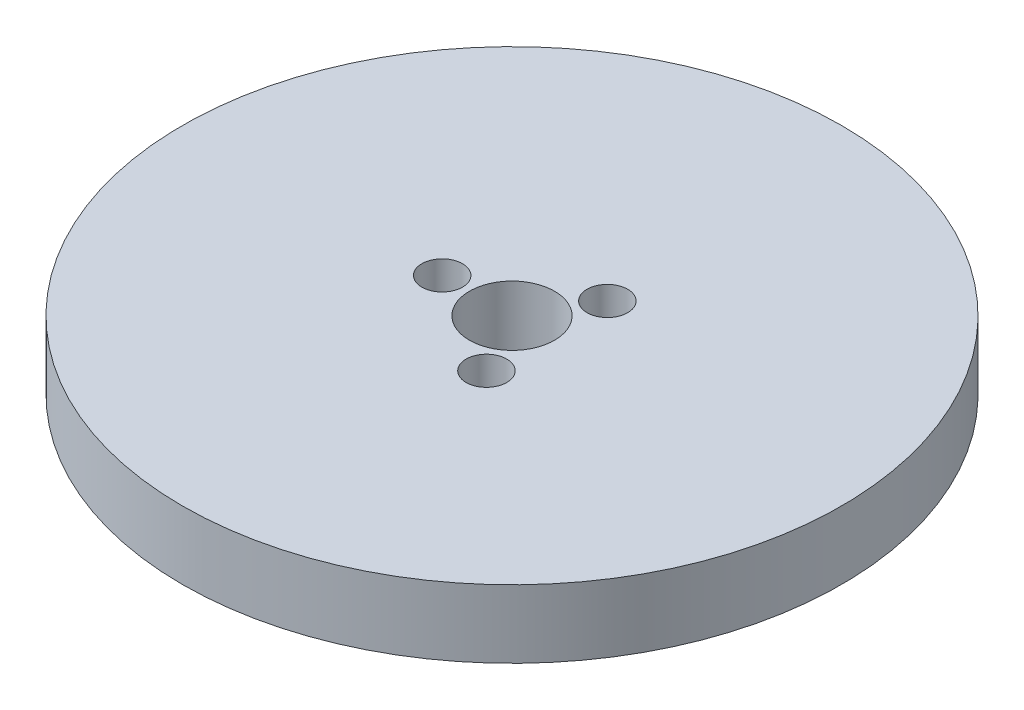
ISO-10303-21;
HEADER;
FILE_DESCRIPTION(('STEP AP214'),'2;1');
FILE_NAME('part.step','',(''),(''),'','','');
FILE_SCHEMA(('AUTOMOTIVE_DESIGN { 1 0 10303 214 1 1 1 1 }'));
ENDSEC;
DATA;
#1=APPLICATION_CONTEXT('core data for automotive mechanical design processes');
#2=APPLICATION_PROTOCOL_DEFINITION('international standard','automotive_design',2000,#1);
#3=PRODUCT_CONTEXT('',#1,'mechanical');
#4=PRODUCT('Part','Part','',(#3));
#5=PRODUCT_RELATED_PRODUCT_CATEGORY('part','',(#4));
#6=PRODUCT_DEFINITION_FORMATION('','',#4);
#7=PRODUCT_DEFINITION_CONTEXT('part definition',#1,'design');
#8=PRODUCT_DEFINITION('design','',#6,#7);
#9=PRODUCT_DEFINITION_SHAPE('','',#8);
#10=(LENGTH_UNIT() NAMED_UNIT(*) SI_UNIT(.MILLI.,.METRE.));
#11=(NAMED_UNIT(*) PLANE_ANGLE_UNIT() SI_UNIT($,.RADIAN.));
#12=(NAMED_UNIT(*) SI_UNIT($,.STERADIAN.) SOLID_ANGLE_UNIT());
#13=UNCERTAINTY_MEASURE_WITH_UNIT(LENGTH_MEASURE(1.E-05),#10,'distance_accuracy_value','');
#14=(GEOMETRIC_REPRESENTATION_CONTEXT(3) GLOBAL_UNCERTAINTY_ASSIGNED_CONTEXT((#13)) GLOBAL_UNIT_ASSIGNED_CONTEXT((#10,
#11,#12)) REPRESENTATION_CONTEXT('',''));
#15=CARTESIAN_POINT('',(0.,0.,0.));
#16=DIRECTION('',(0.,0.,1.));
#17=DIRECTION('',(1.,0.,0.));
#18=AXIS2_PLACEMENT_3D('',#15,#16,#17);
#19=CARTESIAN_POINT('',(0.,16.,0.));
#20=DIRECTION('',(0.,-1.,0.));
#21=DIRECTION('',(0.,0.,-1.));
#22=AXIS2_PLACEMENT_3D('',#19,#20,#21);
#23=CYLINDRICAL_SURFACE('',#22,77.5);
#24=CARTESIAN_POINT('',(0.,16.,0.));
#25=DIRECTION('',(0.,1.,0.));
#26=DIRECTION('',(0.,0.,1.));
#27=AXIS2_PLACEMENT_3D('',#24,#25,#26);
#28=CIRCLE('',#27,77.5);
#29=CARTESIAN_POINT('',(0.,16.,77.5));
#30=VERTEX_POINT('',#29);
#31=EDGE_CURVE('E10',#30,#30,#28,.T.);
#32=ORIENTED_EDGE('',*,*,#31,.F.);
#33=EDGE_LOOP('',(#32));
#34=FACE_BOUND('',#33,.T.);
#35=CARTESIAN_POINT('',(0.,0.,0.));
#36=DIRECTION('',(0.,1.,0.));
#37=DIRECTION('',(0.,0.,1.));
#38=AXIS2_PLACEMENT_3D('',#35,#36,#37);
#39=CIRCLE('',#38,77.5);
#40=CARTESIAN_POINT('',(0.,0.,77.5));
#41=VERTEX_POINT('',#40);
#42=EDGE_CURVE('E37',#41,#41,#39,.T.);
#43=ORIENTED_EDGE('',*,*,#42,.T.);
#44=EDGE_LOOP('',(#43));
#45=FACE_BOUND('',#44,.T.);
#46=ADVANCED_FACE('F40',(#34,#45),#23,.T.);
#47=CARTESIAN_POINT('',(0.,16.,0.));
#48=DIRECTION('',(0.,1.,0.));
#49=DIRECTION('',(0.,0.,1.));
#50=AXIS2_PLACEMENT_3D('',#47,#48,#49);
#51=PLANE('',#50);
#52=CARTESIAN_POINT('',(8.20769700924005,16.,14.2161482331347));
#53=DIRECTION('',(0.,1.,0.));
#54=DIRECTION('',(0.866025403784436,0.,-0.500000000000004));
#55=AXIS2_PLACEMENT_3D('',#52,#53,#54);
#56=CIRCLE('',#55,4.78368247568976);
#57=CARTESIAN_POINT('',(12.3504875568258,16.,11.8243069952898));
#58=VERTEX_POINT('',#57);
#59=EDGE_CURVE('E70',#58,#58,#56,.T.);
#60=ORIENTED_EDGE('',*,*,#59,.F.);
#61=EDGE_LOOP('',(#60));
#62=FACE_BOUND('',#61,.T.);
#63=CARTESIAN_POINT('',(8.20769700923985,16.,-14.2161482331348));
#64=DIRECTION('',(0.,1.,0.));
#65=DIRECTION('',(-0.866025403784443,0.,-0.499999999999992));
#66=AXIS2_PLACEMENT_3D('',#63,#64,#65);
#67=CIRCLE('',#66,4.78368247568976);
#68=CARTESIAN_POINT('',(4.06490646165406,16.,-16.6079894709797));
#69=VERTEX_POINT('',#68);
#70=EDGE_CURVE('E61',#69,#69,#67,.T.);
#71=ORIENTED_EDGE('',*,*,#70,.F.);
#72=EDGE_LOOP('',(#71));
#73=FACE_BOUND('',#72,.T.);
#74=CARTESIAN_POINT('',(-16.41539401848,16.,0.));
#75=DIRECTION('',(0.,1.,0.));
#76=DIRECTION('',(0.,0.,1.));
#77=AXIS2_PLACEMENT_3D('',#74,#75,#76);
#78=CIRCLE('',#77,4.78368247568976);
#79=CARTESIAN_POINT('',(-16.41539401848,16.,4.78368247568976));
#80=VERTEX_POINT('',#79);
#81=EDGE_CURVE('E54',#80,#80,#78,.T.);
#82=ORIENTED_EDGE('',*,*,#81,.F.);
#83=EDGE_LOOP('',(#82));
#84=FACE_BOUND('',#83,.T.);
#85=CARTESIAN_POINT('',(0.,16.,0.));
#86=DIRECTION('',(0.,1.,0.));
#87=DIRECTION('',(0.,0.,1.));
#88=AXIS2_PLACEMENT_3D('',#85,#86,#87);
#89=CIRCLE('',#88,10.);
#90=CARTESIAN_POINT('',(0.,16.,10.));
#91=VERTEX_POINT('',#90);
#92=EDGE_CURVE('E50',#91,#91,#89,.T.);
#93=ORIENTED_EDGE('',*,*,#92,.F.);
#94=EDGE_LOOP('',(#93));
#95=FACE_BOUND('',#94,.T.);
#96=ORIENTED_EDGE('',*,*,#31,.T.);
#97=EDGE_LOOP('',(#96));
#98=FACE_BOUND('',#97,.T.);
#99=ADVANCED_FACE('F85',(#62,#73,#84,#95,#98),#51,.T.);
#100=CARTESIAN_POINT('',(0.,0.,0.));
#101=DIRECTION('',(0.,1.,0.));
#102=DIRECTION('',(0.,0.,1.));
#103=AXIS2_PLACEMENT_3D('',#100,#101,#102);
#104=PLANE('',#103);
#105=CARTESIAN_POINT('',(0.,0.,0.));
#106=DIRECTION('',(0.,1.,0.));
#107=DIRECTION('',(0.,0.,1.));
#108=AXIS2_PLACEMENT_3D('',#105,#106,#107);
#109=CIRCLE('',#108,10.);
#110=CARTESIAN_POINT('',(0.,0.,10.));
#111=VERTEX_POINT('',#110);
#112=EDGE_CURVE('E47',#111,#111,#109,.T.);
#113=ORIENTED_EDGE('',*,*,#112,.T.);
#114=EDGE_LOOP('',(#113));
#115=FACE_BOUND('',#114,.T.);
#116=ORIENTED_EDGE('',*,*,#42,.F.);
#117=EDGE_LOOP('',(#116));
#118=FACE_BOUND('',#117,.T.);
#119=ADVANCED_FACE('F84',(#115,#118),#104,.F.);
#120=CARTESIAN_POINT('',(0.,16.,0.));
#121=DIRECTION('',(0.,-1.,0.));
#122=DIRECTION('',(0.,0.,-1.));
#123=AXIS2_PLACEMENT_3D('',#120,#121,#122);
#124=CYLINDRICAL_SURFACE('',#123,10.);
#125=ORIENTED_EDGE('',*,*,#92,.T.);
#126=EDGE_LOOP('',(#125));
#127=FACE_BOUND('',#126,.T.);
#128=ORIENTED_EDGE('',*,*,#112,.F.);
#129=EDGE_LOOP('',(#128));
#130=FACE_BOUND('',#129,.T.);
#131=ADVANCED_FACE('F91',(#127,#130),#124,.F.);
#132=CARTESIAN_POINT('',(-16.41539401848,0.847264898126794,0.));
#133=DIRECTION('',(0.,1.,0.));
#134=DIRECTION('',(0.,0.,1.));
#135=AXIS2_PLACEMENT_3D('',#132,#133,#134);
#136=CYLINDRICAL_SURFACE('',#135,4.78368247568976);
#137=CARTESIAN_POINT('',(-16.41539401848,0.847264898126794,0.));
#138=DIRECTION('',(0.,1.,0.));
#139=DIRECTION('',(0.,0.,1.));
#140=AXIS2_PLACEMENT_3D('',#137,#138,#139);
#141=CIRCLE('',#140,4.78368247568976);
#142=CARTESIAN_POINT('',(-16.41539401848,0.847264898126794,4.78368247568976));
#143=VERTEX_POINT('',#142);
#144=EDGE_CURVE('E55',#143,#143,#141,.T.);
#145=ORIENTED_EDGE('',*,*,#144,.F.);
#146=EDGE_LOOP('',(#145));
#147=FACE_BOUND('',#146,.T.);
#148=ORIENTED_EDGE('',*,*,#81,.T.);
#149=EDGE_LOOP('',(#148));
#150=FACE_BOUND('',#149,.T.);
#151=ADVANCED_FACE('F96',(#147,#150),#136,.F.);
#152=CARTESIAN_POINT('',(-16.41539401848,0.847264898126794,0.));
#153=DIRECTION('',(0.,1.,0.));
#154=DIRECTION('',(0.,0.,1.));
#155=AXIS2_PLACEMENT_3D('',#152,#153,#154);
#156=PLANE('',#155);
#157=ORIENTED_EDGE('',*,*,#144,.T.);
#158=EDGE_LOOP('',(#157));
#159=FACE_BOUND('',#158,.T.);
#160=ADVANCED_FACE('F127',(#159),#156,.T.);
#161=CARTESIAN_POINT('',(8.20769700923985,0.847264898126794,-14.2161482331348));
#162=DIRECTION('',(0.,1.,0.));
#163=DIRECTION('',(0.,0.,1.));
#164=AXIS2_PLACEMENT_3D('',#161,#162,#163);
#165=CYLINDRICAL_SURFACE('',#164,4.78368247568976);
#166=CARTESIAN_POINT('',(8.20769700923985,0.847264898126794,-14.2161482331348));
#167=DIRECTION('',(0.,1.,0.));
#168=DIRECTION('',(-0.866025403784443,0.,-0.499999999999992));
#169=AXIS2_PLACEMENT_3D('',#166,#167,#168);
#170=CIRCLE('',#169,4.78368247568976);
#171=CARTESIAN_POINT('',(4.06490646165406,0.847264898126794,-16.6079894709797));
#172=VERTEX_POINT('',#171);
#173=EDGE_CURVE('E63',#172,#172,#170,.T.);
#174=ORIENTED_EDGE('',*,*,#173,.F.);
#175=EDGE_LOOP('',(#174));
#176=FACE_BOUND('',#175,.T.);
#177=ORIENTED_EDGE('',*,*,#70,.T.);
#178=EDGE_LOOP('',(#177));
#179=FACE_BOUND('',#178,.T.);
#180=ADVANCED_FACE('F133',(#176,#179),#165,.F.);
#181=CARTESIAN_POINT('',(8.20769700923985,0.847264898126794,-14.2161482331348));
#182=DIRECTION('',(0.,1.,0.));
#183=DIRECTION('',(-0.866025403784443,0.,-0.499999999999992));
#184=AXIS2_PLACEMENT_3D('',#181,#182,#183);
#185=PLANE('',#184);
#186=ORIENTED_EDGE('',*,*,#173,.T.);
#187=EDGE_LOOP('',(#186));
#188=FACE_BOUND('',#187,.T.);
#189=ADVANCED_FACE('F77',(#188),#185,.T.);
#190=CARTESIAN_POINT('',(8.20769700924005,0.847264898126794,14.2161482331347));
#191=DIRECTION('',(0.,1.,0.));
#192=DIRECTION('',(0.,0.,1.));
#193=AXIS2_PLACEMENT_3D('',#190,#191,#192);
#194=CYLINDRICAL_SURFACE('',#193,4.78368247568976);
#195=CARTESIAN_POINT('',(8.20769700924005,0.847264898126794,14.2161482331347));
#196=DIRECTION('',(0.,1.,0.));
#197=DIRECTION('',(0.866025403784436,0.,-0.500000000000004));
#198=AXIS2_PLACEMENT_3D('',#195,#196,#197);
#199=CIRCLE('',#198,4.78368247568976);
#200=CARTESIAN_POINT('',(12.3504875568258,0.847264898126794,11.8243069952898));
#201=VERTEX_POINT('',#200);
#202=EDGE_CURVE('E59',#201,#201,#199,.T.);
#203=ORIENTED_EDGE('',*,*,#202,.F.);
#204=EDGE_LOOP('',(#203));
#205=FACE_BOUND('',#204,.T.);
#206=ORIENTED_EDGE('',*,*,#59,.T.);
#207=EDGE_LOOP('',(#206));
#208=FACE_BOUND('',#207,.T.);
#209=ADVANCED_FACE('F73',(#205,#208),#194,.F.);
#210=CARTESIAN_POINT('',(8.20769700924005,0.847264898126794,14.2161482331347));
#211=DIRECTION('',(0.,1.,0.));
#212=DIRECTION('',(0.866025403784436,0.,-0.500000000000004));
#213=AXIS2_PLACEMENT_3D('',#210,#211,#212);
#214=PLANE('',#213);
#215=ORIENTED_EDGE('',*,*,#202,.T.);
#216=EDGE_LOOP('',(#215));
#217=FACE_BOUND('',#216,.T.);
#218=ADVANCED_FACE('F71',(#217),#214,.T.);
#219=CLOSED_SHELL('',(#46,#99,#119,#131,#151,#160,#180,#189,#209,#218));
#220=MANIFOLD_SOLID_BREP('B2',#219);
#221=ADVANCED_BREP_SHAPE_REPRESENTATION('',(#18,#220),#14);
#222=SHAPE_DEFINITION_REPRESENTATION(#9,#221);
ENDSEC;
END-ISO-10303-21;
